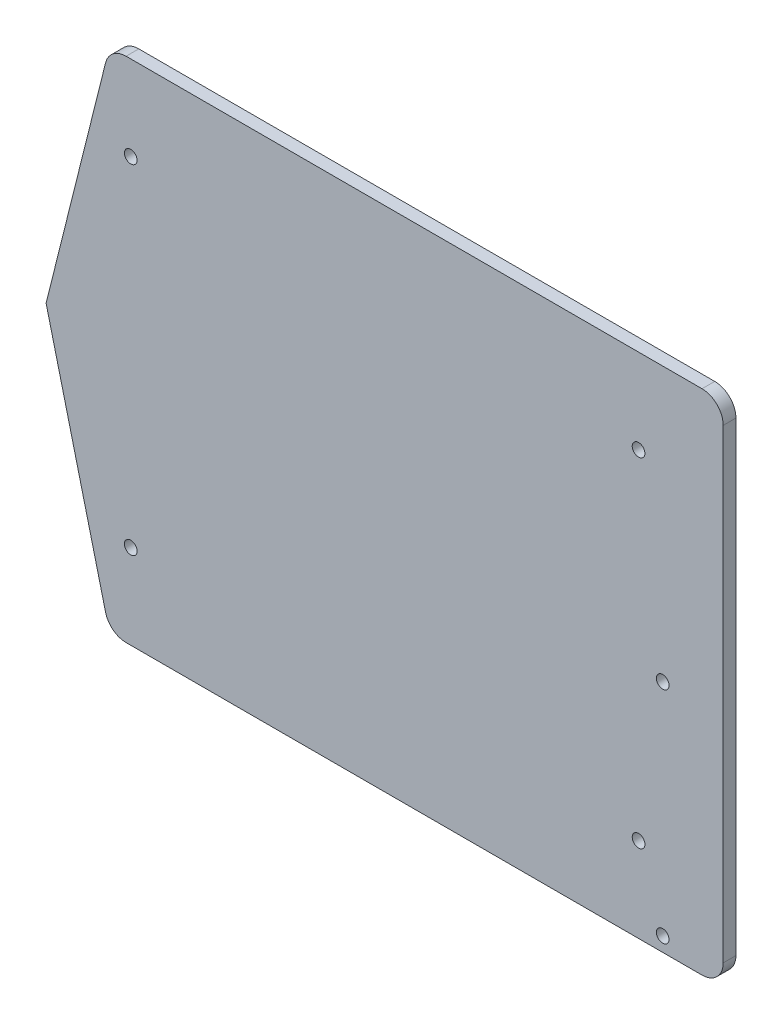
ISO-10303-21;
HEADER;
FILE_DESCRIPTION(('STEP AP214'),'2;1');
FILE_NAME('part.step','',(''),(''),'','','');
FILE_SCHEMA(('AUTOMOTIVE_DESIGN { 1 0 10303 214 1 1 1 1 }'));
ENDSEC;
DATA;
#1=APPLICATION_CONTEXT('core data for automotive mechanical design processes');
#2=APPLICATION_PROTOCOL_DEFINITION('international standard','automotive_design',2000,#1);
#3=PRODUCT_CONTEXT('',#1,'mechanical');
#4=PRODUCT('Part','Part','',(#3));
#5=PRODUCT_RELATED_PRODUCT_CATEGORY('part','',(#4));
#6=PRODUCT_DEFINITION_FORMATION('','',#4);
#7=PRODUCT_DEFINITION_CONTEXT('part definition',#1,'design');
#8=PRODUCT_DEFINITION('design','',#6,#7);
#9=PRODUCT_DEFINITION_SHAPE('','',#8);
#10=(LENGTH_UNIT() NAMED_UNIT(*) SI_UNIT(.MILLI.,.METRE.));
#11=(NAMED_UNIT(*) PLANE_ANGLE_UNIT() SI_UNIT($,.RADIAN.));
#12=(NAMED_UNIT(*) SI_UNIT($,.STERADIAN.) SOLID_ANGLE_UNIT());
#13=UNCERTAINTY_MEASURE_WITH_UNIT(LENGTH_MEASURE(1.E-05),#10,'distance_accuracy_value','');
#14=(GEOMETRIC_REPRESENTATION_CONTEXT(3) GLOBAL_UNCERTAINTY_ASSIGNED_CONTEXT((#13)) GLOBAL_UNIT_ASSIGNED_CONTEXT((#10,
#11,#12)) REPRESENTATION_CONTEXT('',''));
#15=CARTESIAN_POINT('',(0.,0.,0.));
#16=DIRECTION('',(0.,0.,1.));
#17=DIRECTION('',(1.,0.,0.));
#18=AXIS2_PLACEMENT_3D('',#15,#16,#17);
#19=CARTESIAN_POINT('',(0.,0.,3.));
#20=DIRECTION('',(0.,0.,-1.));
#21=DIRECTION('',(-1.,0.,0.));
#22=AXIS2_PLACEMENT_3D('',#19,#20,#21);
#23=PLANE('',#22);
#24=CARTESIAN_POINT('',(145.7,3.37999999999998,3.));
#25=DIRECTION('',(0.,0.,1.));
#26=DIRECTION('',(1.,0.,0.));
#27=AXIS2_PLACEMENT_3D('',#24,#25,#26);
#28=CIRCLE('',#27,1.5);
#29=CARTESIAN_POINT('',(147.2,3.37999999999998,3.));
#30=VERTEX_POINT('',#29);
#31=EDGE_CURVE('E182',#30,#30,#28,.T.);
#32=ORIENTED_EDGE('',*,*,#31,.F.);
#33=EDGE_LOOP('',(#32));
#34=FACE_BOUND('',#33,.T.);
#35=CARTESIAN_POINT('',(145.7,55.38,3.));
#36=DIRECTION('',(0.,0.,1.));
#37=DIRECTION('',(1.,0.,0.));
#38=AXIS2_PLACEMENT_3D('',#35,#36,#37);
#39=CIRCLE('',#38,1.5);
#40=CARTESIAN_POINT('',(147.2,55.38,3.));
#41=VERTEX_POINT('',#40);
#42=EDGE_CURVE('E188',#41,#41,#39,.T.);
#43=ORIENTED_EDGE('',*,*,#42,.F.);
#44=EDGE_LOOP('',(#43));
#45=FACE_BOUND('',#44,.T.);
#46=DIRECTION('',(0.242535625036333,-0.970142500145332,0.));
#47=VECTOR('',#46,1.);
#48=CARTESIAN_POINT('',(0.,60.,3.));
#49=LINE('',#48,#47);
#50=CARTESIAN_POINT('',(0.,60.,3.));
#51=VERTEX_POINT('',#50);
#52=CARTESIAN_POINT('',(14.0531695312954,3.7873218748183,3.));
#53=VERTEX_POINT('',#52);
#54=EDGE_CURVE('E115',#51,#53,#49,.T.);
#55=ORIENTED_EDGE('',*,*,#54,.T.);
#56=CARTESIAN_POINT('',(18.9038820320221,4.99999999999998,3.));
#57=DIRECTION('',(0.,0.,-1.));
#58=DIRECTION('',(-1.,0.,0.));
#59=AXIS2_PLACEMENT_3D('',#56,#57,#58);
#60=CIRCLE('',#59,5.);
#61=CARTESIAN_POINT('',(18.9038820320221,0.,3.));
#62=VERTEX_POINT('',#61);
#63=EDGE_CURVE('E171',#53,#62,#60,.F.);
#64=ORIENTED_EDGE('',*,*,#63,.T.);
#65=DIRECTION('',(1.,0.,0.));
#66=VECTOR('',#65,1.);
#67=CARTESIAN_POINT('',(160.,0.,3.));
#68=LINE('',#67,#66);
#69=CARTESIAN_POINT('',(155.,0.,3.));
#70=VERTEX_POINT('',#69);
#71=EDGE_CURVE('E130',#62,#70,#68,.T.);
#72=ORIENTED_EDGE('',*,*,#71,.T.);
#73=CARTESIAN_POINT('',(155.,5.,3.));
#74=DIRECTION('',(0.,0.,-1.));
#75=DIRECTION('',(-1.,0.,0.));
#76=AXIS2_PLACEMENT_3D('',#73,#74,#75);
#77=CIRCLE('',#76,5.);
#78=CARTESIAN_POINT('',(160.,5.,3.));
#79=VERTEX_POINT('',#78);
#80=EDGE_CURVE('E169',#70,#79,#77,.F.);
#81=ORIENTED_EDGE('',*,*,#80,.T.);
#82=DIRECTION('',(0.,1.,0.));
#83=VECTOR('',#82,1.);
#84=CARTESIAN_POINT('',(160.,120.,3.));
#85=LINE('',#84,#83);
#86=CARTESIAN_POINT('',(160.,115.,3.));
#87=VERTEX_POINT('',#86);
#88=EDGE_CURVE('E151',#79,#87,#85,.T.);
#89=ORIENTED_EDGE('',*,*,#88,.T.);
#90=CARTESIAN_POINT('',(155.,115.,3.));
#91=DIRECTION('',(0.,0.,-1.));
#92=DIRECTION('',(-1.,0.,0.));
#93=AXIS2_PLACEMENT_3D('',#90,#91,#92);
#94=CIRCLE('',#93,5.);
#95=CARTESIAN_POINT('',(155.,120.,3.));
#96=VERTEX_POINT('',#95);
#97=EDGE_CURVE('E167',#87,#96,#94,.F.);
#98=ORIENTED_EDGE('',*,*,#97,.T.);
#99=DIRECTION('',(-1.,0.,0.));
#100=VECTOR('',#99,1.);
#101=CARTESIAN_POINT('',(15.,120.,3.));
#102=LINE('',#101,#100);
#103=CARTESIAN_POINT('',(18.9038820320221,120.,3.));
#104=VERTEX_POINT('',#103);
#105=EDGE_CURVE('E119',#96,#104,#102,.T.);
#106=ORIENTED_EDGE('',*,*,#105,.T.);
#107=CARTESIAN_POINT('',(18.9038820320221,115.,3.));
#108=DIRECTION('',(0.,0.,-1.));
#109=DIRECTION('',(-1.,0.,0.));
#110=AXIS2_PLACEMENT_3D('',#107,#108,#109);
#111=CIRCLE('',#110,5.);
#112=CARTESIAN_POINT('',(14.0531695312954,116.212678125182,3.));
#113=VERTEX_POINT('',#112);
#114=EDGE_CURVE('E55',#104,#113,#111,.F.);
#115=ORIENTED_EDGE('',*,*,#114,.T.);
#116=DIRECTION('',(-0.242535625036333,-0.970142500145332,0.));
#117=VECTOR('',#116,1.);
#118=CARTESIAN_POINT('',(0.,60.,3.));
#119=LINE('',#118,#117);
#120=EDGE_CURVE('E111',#113,#51,#119,.T.);
#121=ORIENTED_EDGE('',*,*,#120,.T.);
#122=EDGE_LOOP('',(#55,#64,#72,#81,#89,#98,#106,#115,#121));
#123=FACE_BOUND('',#122,.T.);
#124=CARTESIAN_POINT('',(20.,20.,3.));
#125=DIRECTION('',(0.,0.,1.));
#126=DIRECTION('',(1.,0.,0.));
#127=AXIS2_PLACEMENT_3D('',#124,#125,#126);
#128=CIRCLE('',#127,1.5);
#129=CARTESIAN_POINT('',(21.5,20.,3.));
#130=VERTEX_POINT('',#129);
#131=EDGE_CURVE('E144',#130,#130,#128,.T.);
#132=ORIENTED_EDGE('',*,*,#131,.F.);
#133=EDGE_LOOP('',(#132));
#134=FACE_BOUND('',#133,.T.);
#135=CARTESIAN_POINT('',(20.,100.,3.));
#136=DIRECTION('',(0.,0.,1.));
#137=DIRECTION('',(-1.,0.,0.));
#138=AXIS2_PLACEMENT_3D('',#135,#136,#137);
#139=CIRCLE('',#138,1.5);
#140=CARTESIAN_POINT('',(18.5,100.,3.));
#141=VERTEX_POINT('',#140);
#142=EDGE_CURVE('E207',#141,#141,#139,.T.);
#143=ORIENTED_EDGE('',*,*,#142,.F.);
#144=EDGE_LOOP('',(#143));
#145=FACE_BOUND('',#144,.T.);
#146=CARTESIAN_POINT('',(140.,20.,3.));
#147=DIRECTION('',(0.,0.,1.));
#148=DIRECTION('',(-1.,0.,0.));
#149=AXIS2_PLACEMENT_3D('',#146,#147,#148);
#150=CIRCLE('',#149,1.5);
#151=CARTESIAN_POINT('',(138.5,20.,3.));
#152=VERTEX_POINT('',#151);
#153=EDGE_CURVE('E201',#152,#152,#150,.T.);
#154=ORIENTED_EDGE('',*,*,#153,.F.);
#155=EDGE_LOOP('',(#154));
#156=FACE_BOUND('',#155,.T.);
#157=CARTESIAN_POINT('',(140.,100.,3.));
#158=DIRECTION('',(0.,0.,1.));
#159=DIRECTION('',(1.,0.,0.));
#160=AXIS2_PLACEMENT_3D('',#157,#158,#159);
#161=CIRCLE('',#160,1.5);
#162=CARTESIAN_POINT('',(141.5,100.,3.));
#163=VERTEX_POINT('',#162);
#164=EDGE_CURVE('E195',#163,#163,#161,.T.);
#165=ORIENTED_EDGE('',*,*,#164,.F.);
#166=EDGE_LOOP('',(#165));
#167=FACE_BOUND('',#166,.T.);
#168=ADVANCED_FACE('F38',(#34,#45,#123,#134,#145,#156,#167),#23,.F.);
#169=CARTESIAN_POINT('',(0.,0.,0.));
#170=DIRECTION('',(0.,0.,-1.));
#171=DIRECTION('',(-1.,0.,0.));
#172=AXIS2_PLACEMENT_3D('',#169,#170,#171);
#173=PLANE('',#172);
#174=CARTESIAN_POINT('',(145.7,3.37999999999998,0.));
#175=DIRECTION('',(0.,0.,-1.));
#176=DIRECTION('',(-1.,0.,0.));
#177=AXIS2_PLACEMENT_3D('',#174,#175,#176);
#178=CIRCLE('',#177,1.5);
#179=CARTESIAN_POINT('',(144.2,3.37999999999998,0.));
#180=VERTEX_POINT('',#179);
#181=EDGE_CURVE('E42',#180,#180,#178,.T.);
#182=ORIENTED_EDGE('',*,*,#181,.F.);
#183=EDGE_LOOP('',(#182));
#184=FACE_BOUND('',#183,.T.);
#185=CARTESIAN_POINT('',(145.7,55.38,0.));
#186=DIRECTION('',(0.,0.,-1.));
#187=DIRECTION('',(-1.,0.,0.));
#188=AXIS2_PLACEMENT_3D('',#185,#186,#187);
#189=CIRCLE('',#188,1.5);
#190=CARTESIAN_POINT('',(144.2,55.38,0.));
#191=VERTEX_POINT('',#190);
#192=EDGE_CURVE('E180',#191,#191,#189,.T.);
#193=ORIENTED_EDGE('',*,*,#192,.F.);
#194=EDGE_LOOP('',(#193));
#195=FACE_BOUND('',#194,.T.);
#196=CARTESIAN_POINT('',(140.,20.,0.));
#197=DIRECTION('',(0.,0.,1.));
#198=DIRECTION('',(-1.,0.,0.));
#199=AXIS2_PLACEMENT_3D('',#196,#197,#198);
#200=CIRCLE('',#199,1.5);
#201=CARTESIAN_POINT('',(138.5,20.,0.));
#202=VERTEX_POINT('',#201);
#203=EDGE_CURVE('E198',#202,#202,#200,.T.);
#204=ORIENTED_EDGE('',*,*,#203,.T.);
#205=EDGE_LOOP('',(#204));
#206=FACE_BOUND('',#205,.T.);
#207=CARTESIAN_POINT('',(20.,20.,0.));
#208=DIRECTION('',(0.,0.,1.));
#209=DIRECTION('',(1.,0.,0.));
#210=AXIS2_PLACEMENT_3D('',#207,#208,#209);
#211=CIRCLE('',#210,1.5);
#212=CARTESIAN_POINT('',(21.5,20.,0.));
#213=VERTEX_POINT('',#212);
#214=EDGE_CURVE('E210',#213,#213,#211,.T.);
#215=ORIENTED_EDGE('',*,*,#214,.T.);
#216=EDGE_LOOP('',(#215));
#217=FACE_BOUND('',#216,.T.);
#218=DIRECTION('',(1.,0.,0.));
#219=VECTOR('',#218,1.);
#220=CARTESIAN_POINT('',(160.,0.,0.));
#221=LINE('',#220,#219);
#222=CARTESIAN_POINT('',(18.9038820320221,0.,0.));
#223=VERTEX_POINT('',#222);
#224=CARTESIAN_POINT('',(155.,0.,0.));
#225=VERTEX_POINT('',#224);
#226=EDGE_CURVE('E149',#223,#225,#221,.T.);
#227=ORIENTED_EDGE('',*,*,#226,.F.);
#228=CARTESIAN_POINT('',(18.9038820320221,4.99999999999998,0.));
#229=DIRECTION('',(0.,0.,-1.));
#230=DIRECTION('',(-1.,0.,0.));
#231=AXIS2_PLACEMENT_3D('',#228,#229,#230);
#232=CIRCLE('',#231,5.);
#233=CARTESIAN_POINT('',(14.0531695312954,3.7873218748183,0.));
#234=VERTEX_POINT('',#233);
#235=EDGE_CURVE('E163',#223,#234,#232,.T.);
#236=ORIENTED_EDGE('',*,*,#235,.T.);
#237=DIRECTION('',(0.242535625036333,-0.970142500145332,0.));
#238=VECTOR('',#237,1.);
#239=CARTESIAN_POINT('',(0.,60.,0.));
#240=LINE('',#239,#238);
#241=CARTESIAN_POINT('',(0.,60.,0.));
#242=VERTEX_POINT('',#241);
#243=EDGE_CURVE('E147',#242,#234,#240,.T.);
#244=ORIENTED_EDGE('',*,*,#243,.F.);
#245=DIRECTION('',(-0.242535625036333,-0.970142500145332,0.));
#246=VECTOR('',#245,1.);
#247=CARTESIAN_POINT('',(0.,60.,0.));
#248=LINE('',#247,#246);
#249=CARTESIAN_POINT('',(14.0531695312954,116.212678125182,0.));
#250=VERTEX_POINT('',#249);
#251=EDGE_CURVE('E125',#250,#242,#248,.T.);
#252=ORIENTED_EDGE('',*,*,#251,.F.);
#253=CARTESIAN_POINT('',(18.9038820320221,115.,0.));
#254=DIRECTION('',(0.,0.,-1.));
#255=DIRECTION('',(-1.,0.,0.));
#256=AXIS2_PLACEMENT_3D('',#253,#254,#255);
#257=CIRCLE('',#256,5.);
#258=CARTESIAN_POINT('',(18.9038820320221,120.,0.));
#259=VERTEX_POINT('',#258);
#260=EDGE_CURVE('E157',#250,#259,#257,.T.);
#261=ORIENTED_EDGE('',*,*,#260,.T.);
#262=DIRECTION('',(-1.,0.,0.));
#263=VECTOR('',#262,1.);
#264=CARTESIAN_POINT('',(15.,120.,0.));
#265=LINE('',#264,#263);
#266=CARTESIAN_POINT('',(155.,120.,0.));
#267=VERTEX_POINT('',#266);
#268=EDGE_CURVE('E143',#267,#259,#265,.T.);
#269=ORIENTED_EDGE('',*,*,#268,.F.);
#270=CARTESIAN_POINT('',(155.,115.,0.));
#271=DIRECTION('',(0.,0.,-1.));
#272=DIRECTION('',(-1.,0.,0.));
#273=AXIS2_PLACEMENT_3D('',#270,#271,#272);
#274=CIRCLE('',#273,5.);
#275=CARTESIAN_POINT('',(160.,115.,0.));
#276=VERTEX_POINT('',#275);
#277=EDGE_CURVE('E159',#267,#276,#274,.T.);
#278=ORIENTED_EDGE('',*,*,#277,.T.);
#279=DIRECTION('',(0.,1.,0.));
#280=VECTOR('',#279,1.);
#281=CARTESIAN_POINT('',(160.,120.,0.));
#282=LINE('',#281,#280);
#283=CARTESIAN_POINT('',(160.,5.,0.));
#284=VERTEX_POINT('',#283);
#285=EDGE_CURVE('E140',#284,#276,#282,.T.);
#286=ORIENTED_EDGE('',*,*,#285,.F.);
#287=CARTESIAN_POINT('',(155.,5.,0.));
#288=DIRECTION('',(0.,0.,-1.));
#289=DIRECTION('',(-1.,0.,0.));
#290=AXIS2_PLACEMENT_3D('',#287,#288,#289);
#291=CIRCLE('',#290,5.);
#292=EDGE_CURVE('E161',#284,#225,#291,.T.);
#293=ORIENTED_EDGE('',*,*,#292,.T.);
#294=EDGE_LOOP('',(#227,#236,#244,#252,#261,#269,#278,#286,#293));
#295=FACE_BOUND('',#294,.T.);
#296=CARTESIAN_POINT('',(20.,100.,0.));
#297=DIRECTION('',(0.,0.,1.));
#298=DIRECTION('',(-1.,0.,0.));
#299=AXIS2_PLACEMENT_3D('',#296,#297,#298);
#300=CIRCLE('',#299,1.5);
#301=CARTESIAN_POINT('',(18.5,100.,0.));
#302=VERTEX_POINT('',#301);
#303=EDGE_CURVE('E204',#302,#302,#300,.T.);
#304=ORIENTED_EDGE('',*,*,#303,.T.);
#305=EDGE_LOOP('',(#304));
#306=FACE_BOUND('',#305,.T.);
#307=CARTESIAN_POINT('',(140.,100.,0.));
#308=DIRECTION('',(0.,0.,1.));
#309=DIRECTION('',(1.,0.,0.));
#310=AXIS2_PLACEMENT_3D('',#307,#308,#309);
#311=CIRCLE('',#310,1.5);
#312=CARTESIAN_POINT('',(141.5,100.,0.));
#313=VERTEX_POINT('',#312);
#314=EDGE_CURVE('E186',#313,#313,#311,.T.);
#315=ORIENTED_EDGE('',*,*,#314,.T.);
#316=EDGE_LOOP('',(#315));
#317=FACE_BOUND('',#316,.T.);
#318=ADVANCED_FACE('F223',(#184,#195,#206,#217,#295,#306,#317),#173,.T.);
#319=CARTESIAN_POINT('',(160.,120.,3.));
#320=DIRECTION('',(-1.,0.,0.));
#321=DIRECTION('',(0.,0.,1.));
#322=AXIS2_PLACEMENT_3D('',#319,#320,#321);
#323=PLANE('',#322);
#324=ORIENTED_EDGE('',*,*,#88,.F.);
#325=DIRECTION('',(0.,0.,-1.));
#326=VECTOR('',#325,1.);
#327=CARTESIAN_POINT('',(160.,5.,3.));
#328=LINE('',#327,#326);
#329=EDGE_CURVE('E175',#79,#284,#328,.T.);
#330=ORIENTED_EDGE('',*,*,#329,.T.);
#331=ORIENTED_EDGE('',*,*,#285,.T.);
#332=DIRECTION('',(0.,0.,-1.));
#333=VECTOR('',#332,1.);
#334=CARTESIAN_POINT('',(160.,115.,3.));
#335=LINE('',#334,#333);
#336=EDGE_CURVE('E173',#276,#87,#335,.F.);
#337=ORIENTED_EDGE('',*,*,#336,.T.);
#338=EDGE_LOOP('',(#324,#330,#331,#337));
#339=FACE_BOUND('',#338,.T.);
#340=ADVANCED_FACE('F239',(#339),#323,.F.);
#341=CARTESIAN_POINT('',(15.,120.,3.));
#342=DIRECTION('',(0.,-1.,0.));
#343=DIRECTION('',(1.,0.,0.));
#344=AXIS2_PLACEMENT_3D('',#341,#342,#343);
#345=PLANE('',#344);
#346=ORIENTED_EDGE('',*,*,#105,.F.);
#347=DIRECTION('',(0.,0.,-1.));
#348=VECTOR('',#347,1.);
#349=CARTESIAN_POINT('',(155.,120.,3.));
#350=LINE('',#349,#348);
#351=EDGE_CURVE('E47',#96,#267,#350,.T.);
#352=ORIENTED_EDGE('',*,*,#351,.T.);
#353=ORIENTED_EDGE('',*,*,#268,.T.);
#354=DIRECTION('',(0.,0.,-1.));
#355=VECTOR('',#354,1.);
#356=CARTESIAN_POINT('',(18.9038820320221,120.,3.));
#357=LINE('',#356,#355);
#358=EDGE_CURVE('E63',#259,#104,#357,.F.);
#359=ORIENTED_EDGE('',*,*,#358,.T.);
#360=EDGE_LOOP('',(#346,#352,#353,#359));
#361=FACE_BOUND('',#360,.T.);
#362=ADVANCED_FACE('F244',(#361),#345,.F.);
#363=CARTESIAN_POINT('',(0.,60.,3.));
#364=DIRECTION('',(0.970142500145332,-0.242535625036333,0.));
#365=DIRECTION('',(0.242535625036333,0.970142500145332,0.));
#366=AXIS2_PLACEMENT_3D('',#363,#364,#365);
#367=PLANE('',#366);
#368=ORIENTED_EDGE('',*,*,#120,.F.);
#369=DIRECTION('',(0.,0.,-1.));
#370=VECTOR('',#369,1.);
#371=CARTESIAN_POINT('',(14.0531695312954,116.212678125182,3.));
#372=LINE('',#371,#370);
#373=EDGE_CURVE('E11',#113,#250,#372,.T.);
#374=ORIENTED_EDGE('',*,*,#373,.T.);
#375=ORIENTED_EDGE('',*,*,#251,.T.);
#376=DIRECTION('',(0.,0.,-1.));
#377=VECTOR('',#376,1.);
#378=CARTESIAN_POINT('',(0.,60.,3.));
#379=LINE('',#378,#377);
#380=EDGE_CURVE('E122',#51,#242,#379,.T.);
#381=ORIENTED_EDGE('',*,*,#380,.F.);
#382=EDGE_LOOP('',(#368,#374,#375,#381));
#383=FACE_BOUND('',#382,.T.);
#384=ADVANCED_FACE('F123',(#383),#367,.F.);
#385=CARTESIAN_POINT('',(0.,60.,3.));
#386=DIRECTION('',(0.970142500145332,0.242535625036333,0.));
#387=DIRECTION('',(-0.242535625036333,0.970142500145332,0.));
#388=AXIS2_PLACEMENT_3D('',#385,#386,#387);
#389=PLANE('',#388);
#390=ORIENTED_EDGE('',*,*,#243,.T.);
#391=DIRECTION('',(0.,0.,-1.));
#392=VECTOR('',#391,1.);
#393=CARTESIAN_POINT('',(14.0531695312954,3.78732187481833,3.));
#394=LINE('',#393,#392);
#395=EDGE_CURVE('E134',#234,#53,#394,.F.);
#396=ORIENTED_EDGE('',*,*,#395,.T.);
#397=ORIENTED_EDGE('',*,*,#54,.F.);
#398=ORIENTED_EDGE('',*,*,#380,.T.);
#399=EDGE_LOOP('',(#390,#396,#397,#398));
#400=FACE_BOUND('',#399,.T.);
#401=ADVANCED_FACE('F132',(#400),#389,.F.);
#402=CARTESIAN_POINT('',(160.,0.,3.));
#403=DIRECTION('',(0.,1.,0.));
#404=DIRECTION('',(-1.,0.,0.));
#405=AXIS2_PLACEMENT_3D('',#402,#403,#404);
#406=PLANE('',#405);
#407=ORIENTED_EDGE('',*,*,#71,.F.);
#408=DIRECTION('',(0.,0.,-1.));
#409=VECTOR('',#408,1.);
#410=CARTESIAN_POINT('',(18.9038820320221,0.,3.));
#411=LINE('',#410,#409);
#412=EDGE_CURVE('E154',#62,#223,#411,.T.);
#413=ORIENTED_EDGE('',*,*,#412,.T.);
#414=ORIENTED_EDGE('',*,*,#226,.T.);
#415=DIRECTION('',(0.,0.,-1.));
#416=VECTOR('',#415,1.);
#417=CARTESIAN_POINT('',(155.,0.,3.));
#418=LINE('',#417,#416);
#419=EDGE_CURVE('E129',#225,#70,#418,.F.);
#420=ORIENTED_EDGE('',*,*,#419,.T.);
#421=EDGE_LOOP('',(#407,#413,#414,#420));
#422=FACE_BOUND('',#421,.T.);
#423=ADVANCED_FACE('F232',(#422),#406,.F.);
#424=CARTESIAN_POINT('',(20.,20.,3.));
#425=DIRECTION('',(0.,0.,-1.));
#426=DIRECTION('',(-1.,0.,0.));
#427=AXIS2_PLACEMENT_3D('',#424,#425,#426);
#428=CYLINDRICAL_SURFACE('',#427,1.5);
#429=ORIENTED_EDGE('',*,*,#131,.T.);
#430=EDGE_LOOP('',(#429));
#431=FACE_BOUND('',#430,.T.);
#432=ORIENTED_EDGE('',*,*,#214,.F.);
#433=EDGE_LOOP('',(#432));
#434=FACE_BOUND('',#433,.T.);
#435=ADVANCED_FACE('F263',(#431,#434),#428,.F.);
#436=CARTESIAN_POINT('',(20.,100.,3.));
#437=DIRECTION('',(0.,0.,-1.));
#438=DIRECTION('',(-1.,0.,0.));
#439=AXIS2_PLACEMENT_3D('',#436,#437,#438);
#440=CYLINDRICAL_SURFACE('',#439,1.5);
#441=ORIENTED_EDGE('',*,*,#142,.T.);
#442=EDGE_LOOP('',(#441));
#443=FACE_BOUND('',#442,.T.);
#444=ORIENTED_EDGE('',*,*,#303,.F.);
#445=EDGE_LOOP('',(#444));
#446=FACE_BOUND('',#445,.T.);
#447=ADVANCED_FACE('F284',(#443,#446),#440,.F.);
#448=CARTESIAN_POINT('',(140.,20.,3.));
#449=DIRECTION('',(0.,0.,-1.));
#450=DIRECTION('',(-1.,0.,0.));
#451=AXIS2_PLACEMENT_3D('',#448,#449,#450);
#452=CYLINDRICAL_SURFACE('',#451,1.5);
#453=ORIENTED_EDGE('',*,*,#153,.T.);
#454=EDGE_LOOP('',(#453));
#455=FACE_BOUND('',#454,.T.);
#456=ORIENTED_EDGE('',*,*,#203,.F.);
#457=EDGE_LOOP('',(#456));
#458=FACE_BOUND('',#457,.T.);
#459=ADVANCED_FACE('F291',(#455,#458),#452,.F.);
#460=CARTESIAN_POINT('',(140.,100.,3.));
#461=DIRECTION('',(0.,0.,-1.));
#462=DIRECTION('',(-1.,0.,0.));
#463=AXIS2_PLACEMENT_3D('',#460,#461,#462);
#464=CYLINDRICAL_SURFACE('',#463,1.5);
#465=ORIENTED_EDGE('',*,*,#164,.T.);
#466=EDGE_LOOP('',(#465));
#467=FACE_BOUND('',#466,.T.);
#468=ORIENTED_EDGE('',*,*,#314,.F.);
#469=EDGE_LOOP('',(#468));
#470=FACE_BOUND('',#469,.T.);
#471=ADVANCED_FACE('F298',(#467,#470),#464,.F.);
#472=CARTESIAN_POINT('',(18.9038820320221,4.99999999999998,3.));
#473=DIRECTION('',(0.,0.,-1.));
#474=DIRECTION('',(-1.,0.,0.));
#475=AXIS2_PLACEMENT_3D('',#472,#473,#474);
#476=CYLINDRICAL_SURFACE('',#475,5.);
#477=ORIENTED_EDGE('',*,*,#63,.F.);
#478=ORIENTED_EDGE('',*,*,#395,.F.);
#479=ORIENTED_EDGE('',*,*,#235,.F.);
#480=ORIENTED_EDGE('',*,*,#412,.F.);
#481=EDGE_LOOP('',(#477,#478,#479,#480));
#482=FACE_BOUND('',#481,.T.);
#483=ADVANCED_FACE('F227',(#482),#476,.T.);
#484=CARTESIAN_POINT('',(155.,5.,3.));
#485=DIRECTION('',(0.,0.,-1.));
#486=DIRECTION('',(-1.,0.,0.));
#487=AXIS2_PLACEMENT_3D('',#484,#485,#486);
#488=CYLINDRICAL_SURFACE('',#487,5.);
#489=ORIENTED_EDGE('',*,*,#80,.F.);
#490=ORIENTED_EDGE('',*,*,#419,.F.);
#491=ORIENTED_EDGE('',*,*,#292,.F.);
#492=ORIENTED_EDGE('',*,*,#329,.F.);
#493=EDGE_LOOP('',(#489,#490,#491,#492));
#494=FACE_BOUND('',#493,.T.);
#495=ADVANCED_FACE('F235',(#494),#488,.T.);
#496=CARTESIAN_POINT('',(155.,115.,3.));
#497=DIRECTION('',(0.,0.,-1.));
#498=DIRECTION('',(-1.,0.,0.));
#499=AXIS2_PLACEMENT_3D('',#496,#497,#498);
#500=CYLINDRICAL_SURFACE('',#499,5.);
#501=ORIENTED_EDGE('',*,*,#97,.F.);
#502=ORIENTED_EDGE('',*,*,#336,.F.);
#503=ORIENTED_EDGE('',*,*,#277,.F.);
#504=ORIENTED_EDGE('',*,*,#351,.F.);
#505=EDGE_LOOP('',(#501,#502,#503,#504));
#506=FACE_BOUND('',#505,.T.);
#507=ADVANCED_FACE('F243',(#506),#500,.T.);
#508=CARTESIAN_POINT('',(18.9038820320221,115.,3.));
#509=DIRECTION('',(0.,0.,-1.));
#510=DIRECTION('',(-1.,0.,0.));
#511=AXIS2_PLACEMENT_3D('',#508,#509,#510);
#512=CYLINDRICAL_SURFACE('',#511,5.);
#513=ORIENTED_EDGE('',*,*,#114,.F.);
#514=ORIENTED_EDGE('',*,*,#358,.F.);
#515=ORIENTED_EDGE('',*,*,#260,.F.);
#516=ORIENTED_EDGE('',*,*,#373,.F.);
#517=EDGE_LOOP('',(#513,#514,#515,#516));
#518=FACE_BOUND('',#517,.T.);
#519=ADVANCED_FACE('F40',(#518),#512,.T.);
#520=CARTESIAN_POINT('',(145.7,55.38,-7.));
#521=DIRECTION('',(0.,0.,1.));
#522=DIRECTION('',(1.,0.,0.));
#523=AXIS2_PLACEMENT_3D('',#520,#521,#522);
#524=CYLINDRICAL_SURFACE('',#523,1.5);
#525=ORIENTED_EDGE('',*,*,#192,.T.);
#526=EDGE_LOOP('',(#525));
#527=FACE_BOUND('',#526,.T.);
#528=ORIENTED_EDGE('',*,*,#42,.T.);
#529=EDGE_LOOP('',(#528));
#530=FACE_BOUND('',#529,.T.);
#531=ADVANCED_FACE('F330',(#527,#530),#524,.F.);
#532=CARTESIAN_POINT('',(145.7,3.37999999999998,-7.));
#533=DIRECTION('',(0.,0.,1.));
#534=DIRECTION('',(1.,0.,0.));
#535=AXIS2_PLACEMENT_3D('',#532,#533,#534);
#536=CYLINDRICAL_SURFACE('',#535,1.5);
#537=ORIENTED_EDGE('',*,*,#181,.T.);
#538=EDGE_LOOP('',(#537));
#539=FACE_BOUND('',#538,.T.);
#540=ORIENTED_EDGE('',*,*,#31,.T.);
#541=EDGE_LOOP('',(#540));
#542=FACE_BOUND('',#541,.T.);
#543=ADVANCED_FACE('F336',(#539,#542),#536,.F.);
#544=CLOSED_SHELL('',(#168,#318,#340,#362,#384,#401,#423,#435,#447,#459,#471,#483,#495,#507,
#519,#531,#543));
#545=MANIFOLD_SOLID_BREP('B2',#544);
#546=ADVANCED_BREP_SHAPE_REPRESENTATION('',(#18,#545),#14);
#547=SHAPE_DEFINITION_REPRESENTATION(#9,#546);
ENDSEC;
END-ISO-10303-21;
